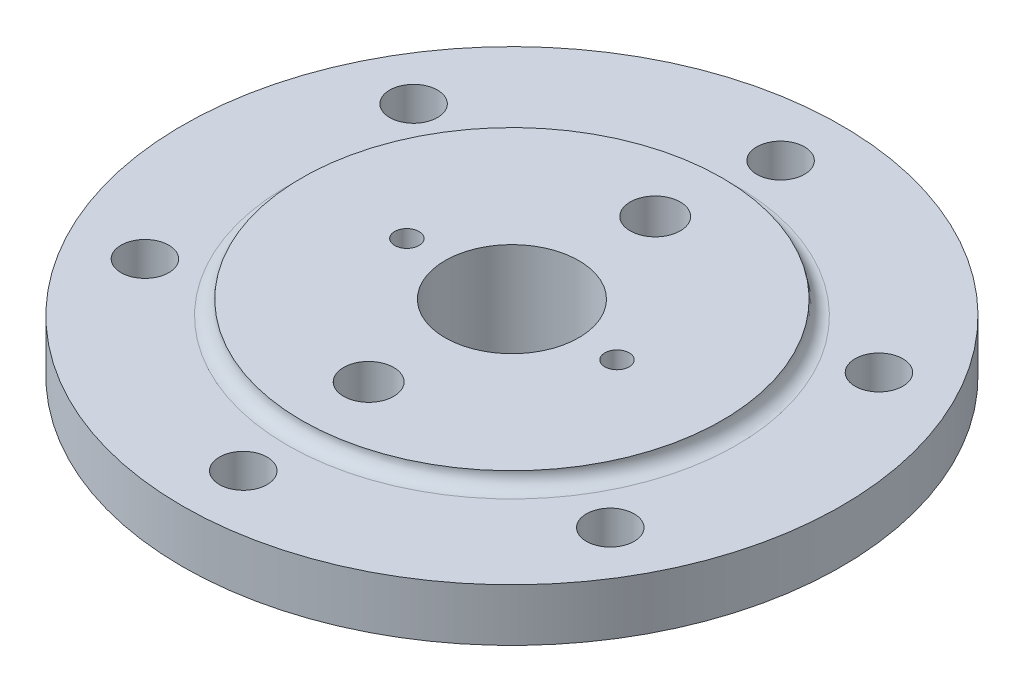
ISO-10303-21;
HEADER;
FILE_DESCRIPTION(('STEP AP214'),'2;1');
FILE_NAME('part.step','',(''),(''),'','','');
FILE_SCHEMA(('AUTOMOTIVE_DESIGN { 1 0 10303 214 1 1 1 1 }'));
ENDSEC;
DATA;
#1=APPLICATION_CONTEXT('core data for automotive mechanical design processes');
#2=APPLICATION_PROTOCOL_DEFINITION('international standard','automotive_design',2000,#1);
#3=PRODUCT_CONTEXT('',#1,'mechanical');
#4=PRODUCT('Part','Part','',(#3));
#5=PRODUCT_RELATED_PRODUCT_CATEGORY('part','',(#4));
#6=PRODUCT_DEFINITION_FORMATION('','',#4);
#7=PRODUCT_DEFINITION_CONTEXT('part definition',#1,'design');
#8=PRODUCT_DEFINITION('design','',#6,#7);
#9=PRODUCT_DEFINITION_SHAPE('','',#8);
#10=(LENGTH_UNIT() NAMED_UNIT(*) SI_UNIT(.MILLI.,.METRE.));
#11=(NAMED_UNIT(*) PLANE_ANGLE_UNIT() SI_UNIT($,.RADIAN.));
#12=(NAMED_UNIT(*) SI_UNIT($,.STERADIAN.) SOLID_ANGLE_UNIT());
#13=UNCERTAINTY_MEASURE_WITH_UNIT(LENGTH_MEASURE(1.E-05),#10,'distance_accuracy_value','');
#14=(GEOMETRIC_REPRESENTATION_CONTEXT(3) GLOBAL_UNCERTAINTY_ASSIGNED_CONTEXT((#13)) GLOBAL_UNIT_ASSIGNED_CONTEXT((#10,
#11,#12)) REPRESENTATION_CONTEXT('',''));
#15=CARTESIAN_POINT('',(0.,0.,0.));
#16=DIRECTION('',(0.,0.,1.));
#17=DIRECTION('',(1.,0.,0.));
#18=AXIS2_PLACEMENT_3D('',#15,#16,#17);
#19=CARTESIAN_POINT('',(0.,40.8228280708899,0.));
#20=DIRECTION('',(0.,1.,0.));
#21=DIRECTION('',(0.,0.,1.));
#22=AXIS2_PLACEMENT_3D('',#19,#20,#21);
#23=CYLINDRICAL_SURFACE('',#22,14.);
#24=CARTESIAN_POINT('',(0.,0.,0.));
#25=DIRECTION('',(0.,1.,0.));
#26=DIRECTION('',(0.,0.,1.));
#27=AXIS2_PLACEMENT_3D('',#24,#25,#26);
#28=CIRCLE('',#27,14.);
#29=CARTESIAN_POINT('',(0.,0.,14.));
#30=VERTEX_POINT('',#29);
#31=EDGE_CURVE('E11',#30,#30,#28,.T.);
#32=ORIENTED_EDGE('',*,*,#31,.F.);
#33=EDGE_LOOP('',(#32));
#34=FACE_BOUND('',#33,.T.);
#35=CARTESIAN_POINT('',(0.,24.9170962313453,0.));
#36=DIRECTION('',(0.,1.,0.));
#37=DIRECTION('',(0.,0.,1.));
#38=AXIS2_PLACEMENT_3D('',#35,#36,#37);
#39=CIRCLE('',#38,14.);
#40=CARTESIAN_POINT('',(0.,24.9170962313453,14.));
#41=VERTEX_POINT('',#40);
#42=EDGE_CURVE('E159',#41,#41,#39,.T.);
#43=ORIENTED_EDGE('',*,*,#42,.T.);
#44=EDGE_LOOP('',(#43));
#45=FACE_BOUND('',#44,.T.);
#46=ADVANCED_FACE('F49',(#34,#45),#23,.F.);
#47=CARTESIAN_POINT('',(0.,0.,-14.));
#48=DIRECTION('',(0.,1.,0.));
#49=DIRECTION('',(0.,0.,1.));
#50=AXIS2_PLACEMENT_3D('',#47,#48,#49);
#51=PLANE('',#50);
#52=CARTESIAN_POINT('',(0.,0.,0.));
#53=DIRECTION('',(0.,1.,0.));
#54=DIRECTION('',(0.,0.,1.));
#55=AXIS2_PLACEMENT_3D('',#52,#53,#54);
#56=CIRCLE('',#55,35.);
#57=CARTESIAN_POINT('',(0.,0.,35.));
#58=VERTEX_POINT('',#57);
#59=EDGE_CURVE('E57',#58,#58,#56,.T.);
#60=ORIENTED_EDGE('',*,*,#59,.F.);
#61=EDGE_LOOP('',(#60));
#62=FACE_BOUND('',#61,.T.);
#63=ORIENTED_EDGE('',*,*,#31,.T.);
#64=EDGE_LOOP('',(#63));
#65=FACE_BOUND('',#64,.T.);
#66=ADVANCED_FACE('F200',(#62,#65),#51,.F.);
#67=CARTESIAN_POINT('',(0.,0.,0.));
#68=DIRECTION('',(0.,1.,0.));
#69=DIRECTION('',(0.,0.,1.));
#70=AXIS2_PLACEMENT_3D('',#67,#68,#69);
#71=CONICAL_SURFACE('',#70,35.,0.774645889606347);
#72=CARTESIAN_POINT('',(0.,47.,0.));
#73=DIRECTION('',(0.,1.,0.));
#74=DIRECTION('',(0.,0.,1.));
#75=AXIS2_PLACEMENT_3D('',#72,#73,#74);
#76=CIRCLE('',#75,81.);
#77=CARTESIAN_POINT('',(0.,47.,81.));
#78=VERTEX_POINT('',#77);
#79=EDGE_CURVE('E191',#78,#78,#76,.T.);
#80=ORIENTED_EDGE('',*,*,#79,.F.);
#81=EDGE_LOOP('',(#80));
#82=FACE_BOUND('',#81,.T.);
#83=ORIENTED_EDGE('',*,*,#59,.T.);
#84=EDGE_LOOP('',(#83));
#85=FACE_BOUND('',#84,.T.);
#86=ADVANCED_FACE('F198',(#82,#85),#71,.T.);
#87=CARTESIAN_POINT('',(0.,40.8228280708899,0.));
#88=DIRECTION('',(0.,1.,0.));
#89=DIRECTION('',(0.,0.,1.));
#90=AXIS2_PLACEMENT_3D('',#87,#88,#89);
#91=CYLINDRICAL_SURFACE('',#90,81.);
#92=CARTESIAN_POINT('',(0.,53.,0.));
#93=DIRECTION('',(0.,1.,0.));
#94=DIRECTION('',(0.,0.,1.));
#95=AXIS2_PLACEMENT_3D('',#92,#93,#94);
#96=CIRCLE('',#95,81.);
#97=CARTESIAN_POINT('',(0.,53.,81.));
#98=VERTEX_POINT('',#97);
#99=EDGE_CURVE('E187',#98,#98,#96,.T.);
#100=ORIENTED_EDGE('',*,*,#99,.F.);
#101=EDGE_LOOP('',(#100));
#102=FACE_BOUND('',#101,.T.);
#103=ORIENTED_EDGE('',*,*,#79,.T.);
#104=EDGE_LOOP('',(#103));
#105=FACE_BOUND('',#104,.T.);
#106=ADVANCED_FACE('F251',(#102,#105),#91,.T.);
#107=CARTESIAN_POINT('',(0.,53.,-81.));
#108=DIRECTION('',(0.,1.,0.));
#109=DIRECTION('',(0.,0.,1.));
#110=AXIS2_PLACEMENT_3D('',#107,#108,#109);
#111=PLANE('',#110);
#112=CARTESIAN_POINT('',(0.,53.,-112.5));
#113=DIRECTION('',(0.,1.,0.));
#114=DIRECTION('',(0.,0.,1.));
#115=AXIS2_PLACEMENT_3D('',#112,#113,#114);
#116=CIRCLE('',#115,10.);
#117=CARTESIAN_POINT('',(0.,53.,-102.5));
#118=VERTEX_POINT('',#117);
#119=EDGE_CURVE('E155',#118,#118,#116,.T.);
#120=ORIENTED_EDGE('',*,*,#119,.T.);
#121=EDGE_LOOP('',(#120));
#122=FACE_BOUND('',#121,.T.);
#123=CARTESIAN_POINT('',(-97.4278579257487,53.,-56.2500000000012));
#124=DIRECTION('',(0.,1.,0.));
#125=DIRECTION('',(0.,0.,1.));
#126=AXIS2_PLACEMENT_3D('',#123,#124,#125);
#127=CIRCLE('',#126,10.);
#128=CARTESIAN_POINT('',(-97.4278579257487,53.,-46.2500000000012));
#129=VERTEX_POINT('',#128);
#130=EDGE_CURVE('E151',#129,#129,#127,.T.);
#131=ORIENTED_EDGE('',*,*,#130,.T.);
#132=EDGE_LOOP('',(#131));
#133=FACE_BOUND('',#132,.T.);
#134=CARTESIAN_POINT('',(-97.4278579257499,53.,56.2499999999991));
#135=DIRECTION('',(0.,1.,0.));
#136=DIRECTION('',(0.,0.,1.));
#137=AXIS2_PLACEMENT_3D('',#134,#135,#136);
#138=CIRCLE('',#137,10.);
#139=CARTESIAN_POINT('',(-97.4278579257499,53.,66.2499999999991));
#140=VERTEX_POINT('',#139);
#141=EDGE_CURVE('E147',#140,#140,#138,.T.);
#142=ORIENTED_EDGE('',*,*,#141,.T.);
#143=EDGE_LOOP('',(#142));
#144=FACE_BOUND('',#143,.T.);
#145=CARTESIAN_POINT('',(-7.85583301239705E-13,53.,112.5));
#146=DIRECTION('',(0.,1.,0.));
#147=DIRECTION('',(0.,0.,1.));
#148=AXIS2_PLACEMENT_3D('',#145,#146,#147);
#149=CIRCLE('',#148,10.);
#150=CARTESIAN_POINT('',(-7.85583301239705E-13,53.,122.5));
#151=VERTEX_POINT('',#150);
#152=EDGE_CURVE('E143',#151,#151,#149,.T.);
#153=ORIENTED_EDGE('',*,*,#152,.T.);
#154=EDGE_LOOP('',(#153));
#155=FACE_BOUND('',#154,.T.);
#156=CARTESIAN_POINT('',(97.4278579257491,53.,56.2500000000005));
#157=DIRECTION('',(0.,1.,0.));
#158=DIRECTION('',(0.,0.,1.));
#159=AXIS2_PLACEMENT_3D('',#156,#157,#158);
#160=CIRCLE('',#159,10.);
#161=CARTESIAN_POINT('',(97.4278579257491,53.,66.2500000000005));
#162=VERTEX_POINT('',#161);
#163=EDGE_CURVE('E139',#162,#162,#160,.T.);
#164=ORIENTED_EDGE('',*,*,#163,.T.);
#165=EDGE_LOOP('',(#164));
#166=FACE_BOUND('',#165,.T.);
#167=CARTESIAN_POINT('',(97.4278579257495,53.,-56.2499999999998));
#168=DIRECTION('',(0.,1.,0.));
#169=DIRECTION('',(0.,0.,1.));
#170=AXIS2_PLACEMENT_3D('',#167,#168,#169);
#171=CIRCLE('',#170,9.99999999999999);
#172=CARTESIAN_POINT('',(97.4278579257495,53.,-46.2499999999998));
#173=VERTEX_POINT('',#172);
#174=EDGE_CURVE('E116',#173,#173,#171,.T.);
#175=ORIENTED_EDGE('',*,*,#174,.T.);
#176=EDGE_LOOP('',(#175));
#177=FACE_BOUND('',#176,.T.);
#178=CARTESIAN_POINT('',(0.,53.,0.));
#179=DIRECTION('',(0.,1.,0.));
#180=DIRECTION('',(0.,0.,1.));
#181=AXIS2_PLACEMENT_3D('',#178,#179,#180);
#182=CIRCLE('',#181,138.);
#183=CARTESIAN_POINT('',(0.,53.,138.));
#184=VERTEX_POINT('',#183);
#185=EDGE_CURVE('E183',#184,#184,#182,.T.);
#186=ORIENTED_EDGE('',*,*,#185,.F.);
#187=EDGE_LOOP('',(#186));
#188=FACE_BOUND('',#187,.T.);
#189=ORIENTED_EDGE('',*,*,#99,.T.);
#190=EDGE_LOOP('',(#189));
#191=FACE_BOUND('',#190,.T.);
#192=ADVANCED_FACE('F245',(#122,#133,#144,#155,#166,#177,#188,#191),#111,.F.);
#193=CARTESIAN_POINT('',(0.,40.8228280708899,0.));
#194=DIRECTION('',(0.,1.,0.));
#195=DIRECTION('',(0.,0.,1.));
#196=AXIS2_PLACEMENT_3D('',#193,#194,#195);
#197=CYLINDRICAL_SURFACE('',#196,138.);
#198=CARTESIAN_POINT('',(0.,75.,0.));
#199=DIRECTION('',(0.,1.,0.));
#200=DIRECTION('',(0.,0.,1.));
#201=AXIS2_PLACEMENT_3D('',#198,#199,#200);
#202=CIRCLE('',#201,138.);
#203=CARTESIAN_POINT('',(0.,75.,138.));
#204=VERTEX_POINT('',#203);
#205=EDGE_CURVE('E179',#204,#204,#202,.T.);
#206=ORIENTED_EDGE('',*,*,#205,.F.);
#207=EDGE_LOOP('',(#206));
#208=FACE_BOUND('',#207,.T.);
#209=ORIENTED_EDGE('',*,*,#185,.T.);
#210=EDGE_LOOP('',(#209));
#211=FACE_BOUND('',#210,.T.);
#212=ADVANCED_FACE('F238',(#208,#211),#197,.T.);
#213=CARTESIAN_POINT('',(0.,75.,-138.));
#214=DIRECTION('',(0.,-1.,0.));
#215=DIRECTION('',(0.,0.,-1.));
#216=AXIS2_PLACEMENT_3D('',#213,#214,#215);
#217=PLANE('',#216);
#218=CARTESIAN_POINT('',(0.,75.,-112.5));
#219=DIRECTION('',(0.,1.,0.));
#220=DIRECTION('',(0.,0.,1.));
#221=AXIS2_PLACEMENT_3D('',#218,#219,#220);
#222=CIRCLE('',#221,10.);
#223=CARTESIAN_POINT('',(0.,75.,-102.5));
#224=VERTEX_POINT('',#223);
#225=EDGE_CURVE('E112',#224,#224,#222,.T.);
#226=ORIENTED_EDGE('',*,*,#225,.F.);
#227=EDGE_LOOP('',(#226));
#228=FACE_BOUND('',#227,.T.);
#229=CARTESIAN_POINT('',(-97.4278579257487,75.,-56.2500000000012));
#230=DIRECTION('',(0.,1.,0.));
#231=DIRECTION('',(0.,0.,1.));
#232=AXIS2_PLACEMENT_3D('',#229,#230,#231);
#233=CIRCLE('',#232,10.);
#234=CARTESIAN_POINT('',(-97.4278579257487,75.,-46.2500000000012));
#235=VERTEX_POINT('',#234);
#236=EDGE_CURVE('E111',#235,#235,#233,.T.);
#237=ORIENTED_EDGE('',*,*,#236,.F.);
#238=EDGE_LOOP('',(#237));
#239=FACE_BOUND('',#238,.T.);
#240=CARTESIAN_POINT('',(-97.4278579257499,75.,56.2499999999991));
#241=DIRECTION('',(0.,1.,0.));
#242=DIRECTION('',(0.,0.,1.));
#243=AXIS2_PLACEMENT_3D('',#240,#241,#242);
#244=CIRCLE('',#243,10.);
#245=CARTESIAN_POINT('',(-97.4278579257499,75.,66.2499999999991));
#246=VERTEX_POINT('',#245);
#247=EDGE_CURVE('E121',#246,#246,#244,.T.);
#248=ORIENTED_EDGE('',*,*,#247,.F.);
#249=EDGE_LOOP('',(#248));
#250=FACE_BOUND('',#249,.T.);
#251=CARTESIAN_POINT('',(-7.85583301239705E-13,75.,112.5));
#252=DIRECTION('',(0.,1.,0.));
#253=DIRECTION('',(0.,0.,1.));
#254=AXIS2_PLACEMENT_3D('',#251,#252,#253);
#255=CIRCLE('',#254,10.);
#256=CARTESIAN_POINT('',(-7.85583301239705E-13,75.,122.5));
#257=VERTEX_POINT('',#256);
#258=EDGE_CURVE('E129',#257,#257,#255,.T.);
#259=ORIENTED_EDGE('',*,*,#258,.F.);
#260=EDGE_LOOP('',(#259));
#261=FACE_BOUND('',#260,.T.);
#262=CARTESIAN_POINT('',(97.4278579257491,75.,56.2500000000005));
#263=DIRECTION('',(0.,1.,0.));
#264=DIRECTION('',(0.,0.,1.));
#265=AXIS2_PLACEMENT_3D('',#262,#263,#264);
#266=CIRCLE('',#265,10.);
#267=CARTESIAN_POINT('',(97.4278579257491,75.,66.2500000000005));
#268=VERTEX_POINT('',#267);
#269=EDGE_CURVE('E125',#268,#268,#266,.T.);
#270=ORIENTED_EDGE('',*,*,#269,.F.);
#271=EDGE_LOOP('',(#270));
#272=FACE_BOUND('',#271,.T.);
#273=CARTESIAN_POINT('',(97.4278579257495,75.,-56.2499999999998));
#274=DIRECTION('',(0.,1.,0.));
#275=DIRECTION('',(0.,0.,1.));
#276=AXIS2_PLACEMENT_3D('',#273,#274,#275);
#277=CIRCLE('',#276,9.99999999999999);
#278=CARTESIAN_POINT('',(97.4278579257495,75.,-46.2499999999998));
#279=VERTEX_POINT('',#278);
#280=EDGE_CURVE('E117',#279,#279,#277,.T.);
#281=ORIENTED_EDGE('',*,*,#280,.F.);
#282=EDGE_LOOP('',(#281));
#283=FACE_BOUND('',#282,.T.);
#284=CARTESIAN_POINT('',(0.,75.,0.));
#285=DIRECTION('',(0.,1.,0.));
#286=DIRECTION('',(0.,0.,1.));
#287=AXIS2_PLACEMENT_3D('',#284,#285,#286);
#288=CIRCLE('',#287,94.);
#289=CARTESIAN_POINT('',(0.,75.,94.));
#290=VERTEX_POINT('',#289);
#291=EDGE_CURVE('E175',#290,#290,#288,.T.);
#292=ORIENTED_EDGE('',*,*,#291,.F.);
#293=EDGE_LOOP('',(#292));
#294=FACE_BOUND('',#293,.T.);
#295=ORIENTED_EDGE('',*,*,#205,.T.);
#296=EDGE_LOOP('',(#295));
#297=FACE_BOUND('',#296,.T.);
#298=ADVANCED_FACE('F232',(#228,#239,#250,#261,#272,#283,#294,#297),#217,.F.);
#299=CARTESIAN_POINT('',(0.,81.,0.));
#300=DIRECTION('',(0.,1.,0.));
#301=DIRECTION('',(0.,0.,1.));
#302=AXIS2_PLACEMENT_3D('',#299,#300,#301);
#303=TOROIDAL_SURFACE('',#302,94.,6.00000000000001);
#304=CARTESIAN_POINT('',(0.,81.,0.));
#305=DIRECTION('',(0.,1.,0.));
#306=DIRECTION('',(0.,0.,1.));
#307=AXIS2_PLACEMENT_3D('',#304,#305,#306);
#308=CIRCLE('',#307,88.);
#309=CARTESIAN_POINT('',(0.,81.,88.));
#310=VERTEX_POINT('',#309);
#311=EDGE_CURVE('E171',#310,#310,#308,.T.);
#312=ORIENTED_EDGE('',*,*,#311,.F.);
#313=EDGE_LOOP('',(#312));
#314=FACE_BOUND('',#313,.T.);
#315=ORIENTED_EDGE('',*,*,#291,.T.);
#316=EDGE_LOOP('',(#315));
#317=FACE_BOUND('',#316,.T.);
#318=ADVANCED_FACE('F225',(#314,#317),#303,.F.);
#319=CARTESIAN_POINT('',(0.,81.,-88.));
#320=DIRECTION('',(0.,-1.,0.));
#321=DIRECTION('',(0.,0.,-1.));
#322=AXIS2_PLACEMENT_3D('',#319,#320,#321);
#323=PLANE('',#322);
#324=CARTESIAN_POINT('',(-44.,81.,0.));
#325=DIRECTION('',(0.,1.,0.));
#326=DIRECTION('',(0.,0.,1.));
#327=AXIS2_PLACEMENT_3D('',#324,#325,#326);
#328=CIRCLE('',#327,5.09999999999999);
#329=CARTESIAN_POINT('',(-44.,81.,5.09999999999999));
#330=VERTEX_POINT('',#329);
#331=EDGE_CURVE('E82',#330,#330,#328,.T.);
#332=ORIENTED_EDGE('',*,*,#331,.F.);
#333=EDGE_LOOP('',(#332));
#334=FACE_BOUND('',#333,.T.);
#335=CARTESIAN_POINT('',(44.,81.,0.));
#336=DIRECTION('',(0.,1.,0.));
#337=DIRECTION('',(0.,0.,1.));
#338=AXIS2_PLACEMENT_3D('',#335,#336,#337);
#339=CIRCLE('',#338,5.09999999999999);
#340=CARTESIAN_POINT('',(44.,81.,5.09999999999998));
#341=VERTEX_POINT('',#340);
#342=EDGE_CURVE('E81',#341,#341,#339,.T.);
#343=ORIENTED_EDGE('',*,*,#342,.F.);
#344=EDGE_LOOP('',(#343));
#345=FACE_BOUND('',#344,.T.);
#346=CARTESIAN_POINT('',(0.,81.,60.));
#347=DIRECTION('',(0.,1.,0.));
#348=DIRECTION('',(0.,0.,1.));
#349=AXIS2_PLACEMENT_3D('',#346,#347,#348);
#350=CIRCLE('',#349,10.5);
#351=CARTESIAN_POINT('',(0.,81.,70.5));
#352=VERTEX_POINT('',#351);
#353=EDGE_CURVE('E95',#352,#352,#350,.T.);
#354=ORIENTED_EDGE('',*,*,#353,.F.);
#355=EDGE_LOOP('',(#354));
#356=FACE_BOUND('',#355,.T.);
#357=CARTESIAN_POINT('',(0.,81.,-60.));
#358=DIRECTION('',(0.,1.,0.));
#359=DIRECTION('',(0.,0.,1.));
#360=AXIS2_PLACEMENT_3D('',#357,#358,#359);
#361=CIRCLE('',#360,10.5);
#362=CARTESIAN_POINT('',(0.,81.,-49.5));
#363=VERTEX_POINT('',#362);
#364=EDGE_CURVE('E103',#363,#363,#361,.T.);
#365=ORIENTED_EDGE('',*,*,#364,.F.);
#366=EDGE_LOOP('',(#365));
#367=FACE_BOUND('',#366,.T.);
#368=CARTESIAN_POINT('',(0.,81.,0.));
#369=DIRECTION('',(0.,1.,0.));
#370=DIRECTION('',(0.,0.,1.));
#371=AXIS2_PLACEMENT_3D('',#368,#369,#370);
#372=CIRCLE('',#371,28.);
#373=CARTESIAN_POINT('',(0.,81.,28.));
#374=VERTEX_POINT('',#373);
#375=EDGE_CURVE('E167',#374,#374,#372,.T.);
#376=ORIENTED_EDGE('',*,*,#375,.F.);
#377=EDGE_LOOP('',(#376));
#378=FACE_BOUND('',#377,.T.);
#379=ORIENTED_EDGE('',*,*,#311,.T.);
#380=EDGE_LOOP('',(#379));
#381=FACE_BOUND('',#380,.T.);
#382=ADVANCED_FACE('F219',(#334,#345,#356,#367,#378,#381),#323,.F.);
#383=CARTESIAN_POINT('',(0.,40.8228280708899,0.));
#384=DIRECTION('',(0.,1.,0.));
#385=DIRECTION('',(0.,0.,1.));
#386=AXIS2_PLACEMENT_3D('',#383,#384,#385);
#387=CYLINDRICAL_SURFACE('',#386,28.);
#388=CARTESIAN_POINT('',(0.,33.,0.));
#389=DIRECTION('',(0.,1.,0.));
#390=DIRECTION('',(0.,0.,1.));
#391=AXIS2_PLACEMENT_3D('',#388,#389,#390);
#392=CIRCLE('',#391,28.);
#393=CARTESIAN_POINT('',(0.,33.,28.));
#394=VERTEX_POINT('',#393);
#395=EDGE_CURVE('E163',#394,#394,#392,.T.);
#396=ORIENTED_EDGE('',*,*,#395,.F.);
#397=EDGE_LOOP('',(#396));
#398=FACE_BOUND('',#397,.T.);
#399=ORIENTED_EDGE('',*,*,#375,.T.);
#400=EDGE_LOOP('',(#399));
#401=FACE_BOUND('',#400,.T.);
#402=ADVANCED_FACE('F213',(#398,#401),#387,.F.);
#403=CARTESIAN_POINT('',(0.,33.,0.));
#404=DIRECTION('',(0.,1.,0.));
#405=DIRECTION('',(0.,0.,1.));
#406=AXIS2_PLACEMENT_3D('',#403,#404,#405);
#407=CONICAL_SURFACE('',#406,28.,1.0471975511966);
#408=ORIENTED_EDGE('',*,*,#42,.F.);
#409=EDGE_LOOP('',(#408));
#410=FACE_BOUND('',#409,.T.);
#411=ORIENTED_EDGE('',*,*,#395,.T.);
#412=EDGE_LOOP('',(#411));
#413=FACE_BOUND('',#412,.T.);
#414=ADVANCED_FACE('F209',(#410,#413),#407,.F.);
#415=CARTESIAN_POINT('',(97.4278579257495,0.,-56.2499999999998));
#416=DIRECTION('',(0.,1.,0.));
#417=DIRECTION('',(0.,0.,1.));
#418=AXIS2_PLACEMENT_3D('',#415,#416,#417);
#419=CYLINDRICAL_SURFACE('',#418,9.99999999999999);
#420=ORIENTED_EDGE('',*,*,#280,.T.);
#421=EDGE_LOOP('',(#420));
#422=FACE_BOUND('',#421,.T.);
#423=ORIENTED_EDGE('',*,*,#174,.F.);
#424=EDGE_LOOP('',(#423));
#425=FACE_BOUND('',#424,.T.);
#426=ADVANCED_FACE('F212',(#422,#425),#419,.F.);
#427=CARTESIAN_POINT('',(97.4278579257491,0.,56.2500000000005));
#428=DIRECTION('',(0.,1.,0.));
#429=DIRECTION('',(0.,0.,1.));
#430=AXIS2_PLACEMENT_3D('',#427,#428,#429);
#431=CYLINDRICAL_SURFACE('',#430,10.);
#432=ORIENTED_EDGE('',*,*,#269,.T.);
#433=EDGE_LOOP('',(#432));
#434=FACE_BOUND('',#433,.T.);
#435=ORIENTED_EDGE('',*,*,#163,.F.);
#436=EDGE_LOOP('',(#435));
#437=FACE_BOUND('',#436,.T.);
#438=ADVANCED_FACE('F274',(#434,#437),#431,.F.);
#439=CARTESIAN_POINT('',(-7.85583301239705E-13,0.,112.5));
#440=DIRECTION('',(0.,1.,0.));
#441=DIRECTION('',(0.,0.,1.));
#442=AXIS2_PLACEMENT_3D('',#439,#440,#441);
#443=CYLINDRICAL_SURFACE('',#442,10.);
#444=ORIENTED_EDGE('',*,*,#258,.T.);
#445=EDGE_LOOP('',(#444));
#446=FACE_BOUND('',#445,.T.);
#447=ORIENTED_EDGE('',*,*,#152,.F.);
#448=EDGE_LOOP('',(#447));
#449=FACE_BOUND('',#448,.T.);
#450=ADVANCED_FACE('F270',(#446,#449),#443,.F.);
#451=CARTESIAN_POINT('',(-97.4278579257499,0.,56.2499999999991));
#452=DIRECTION('',(0.,1.,0.));
#453=DIRECTION('',(0.,0.,1.));
#454=AXIS2_PLACEMENT_3D('',#451,#452,#453);
#455=CYLINDRICAL_SURFACE('',#454,10.);
#456=ORIENTED_EDGE('',*,*,#247,.T.);
#457=EDGE_LOOP('',(#456));
#458=FACE_BOUND('',#457,.T.);
#459=ORIENTED_EDGE('',*,*,#141,.F.);
#460=EDGE_LOOP('',(#459));
#461=FACE_BOUND('',#460,.T.);
#462=ADVANCED_FACE('F266',(#458,#461),#455,.F.);
#463=CARTESIAN_POINT('',(-97.4278579257487,0.,-56.2500000000012));
#464=DIRECTION('',(0.,1.,0.));
#465=DIRECTION('',(0.,0.,1.));
#466=AXIS2_PLACEMENT_3D('',#463,#464,#465);
#467=CYLINDRICAL_SURFACE('',#466,10.);
#468=ORIENTED_EDGE('',*,*,#236,.T.);
#469=EDGE_LOOP('',(#468));
#470=FACE_BOUND('',#469,.T.);
#471=ORIENTED_EDGE('',*,*,#130,.F.);
#472=EDGE_LOOP('',(#471));
#473=FACE_BOUND('',#472,.T.);
#474=ADVANCED_FACE('F269',(#470,#473),#467,.F.);
#475=CARTESIAN_POINT('',(0.,0.,-112.5));
#476=DIRECTION('',(0.,1.,0.));
#477=DIRECTION('',(0.,0.,1.));
#478=AXIS2_PLACEMENT_3D('',#475,#476,#477);
#479=CYLINDRICAL_SURFACE('',#478,10.);
#480=ORIENTED_EDGE('',*,*,#225,.T.);
#481=EDGE_LOOP('',(#480));
#482=FACE_BOUND('',#481,.T.);
#483=ORIENTED_EDGE('',*,*,#119,.F.);
#484=EDGE_LOOP('',(#483));
#485=FACE_BOUND('',#484,.T.);
#486=ADVANCED_FACE('F284',(#482,#485),#479,.F.);
#487=CARTESIAN_POINT('',(0.,54.,-60.));
#488=DIRECTION('',(0.,1.,0.));
#489=DIRECTION('',(0.,0.,1.));
#490=AXIS2_PLACEMENT_3D('',#487,#488,#489);
#491=CONICAL_SURFACE('',#490,10.5,1.02974425867665);
#492=CARTESIAN_POINT('',(0.,47.6909635002106,-60.));
#493=VERTEX_POINT('',#492);
#494=VERTEX_LOOP('',#493);
#495=FACE_BOUND('',#494,.T.);
#496=CARTESIAN_POINT('',(0.,54.,-60.));
#497=DIRECTION('',(0.,1.,0.));
#498=DIRECTION('',(0.,0.,1.));
#499=AXIS2_PLACEMENT_3D('',#496,#497,#498);
#500=CIRCLE('',#499,10.5);
#501=CARTESIAN_POINT('',(0.,54.,-49.5));
#502=VERTEX_POINT('',#501);
#503=EDGE_CURVE('E107',#502,#502,#500,.T.);
#504=ORIENTED_EDGE('',*,*,#503,.T.);
#505=EDGE_LOOP('',(#504));
#506=FACE_BOUND('',#505,.T.);
#507=ADVANCED_FACE('F288',(#495,#506),#491,.F.);
#508=CARTESIAN_POINT('',(0.,81.,-60.));
#509=DIRECTION('',(0.,1.,0.));
#510=DIRECTION('',(0.,0.,1.));
#511=AXIS2_PLACEMENT_3D('',#508,#509,#510);
#512=CYLINDRICAL_SURFACE('',#511,10.5);
#513=ORIENTED_EDGE('',*,*,#503,.F.);
#514=EDGE_LOOP('',(#513));
#515=FACE_BOUND('',#514,.T.);
#516=ORIENTED_EDGE('',*,*,#364,.T.);
#517=EDGE_LOOP('',(#516));
#518=FACE_BOUND('',#517,.T.);
#519=ADVANCED_FACE('F292',(#515,#518),#512,.F.);
#520=CARTESIAN_POINT('',(0.,54.,60.));
#521=DIRECTION('',(0.,1.,0.));
#522=DIRECTION('',(0.,0.,1.));
#523=AXIS2_PLACEMENT_3D('',#520,#521,#522);
#524=CONICAL_SURFACE('',#523,10.5,1.02974425867665);
#525=CARTESIAN_POINT('',(0.,47.6909635002106,60.));
#526=VERTEX_POINT('',#525);
#527=VERTEX_LOOP('',#526);
#528=FACE_BOUND('',#527,.T.);
#529=CARTESIAN_POINT('',(0.,54.,60.));
#530=DIRECTION('',(0.,1.,0.));
#531=DIRECTION('',(0.,0.,1.));
#532=AXIS2_PLACEMENT_3D('',#529,#530,#531);
#533=CIRCLE('',#532,10.5);
#534=CARTESIAN_POINT('',(0.,54.,70.5));
#535=VERTEX_POINT('',#534);
#536=EDGE_CURVE('E99',#535,#535,#533,.T.);
#537=ORIENTED_EDGE('',*,*,#536,.T.);
#538=EDGE_LOOP('',(#537));
#539=FACE_BOUND('',#538,.T.);
#540=ADVANCED_FACE('F295',(#528,#539),#524,.F.);
#541=CARTESIAN_POINT('',(0.,81.,60.));
#542=DIRECTION('',(0.,1.,0.));
#543=DIRECTION('',(0.,0.,1.));
#544=AXIS2_PLACEMENT_3D('',#541,#542,#543);
#545=CYLINDRICAL_SURFACE('',#544,10.5);
#546=ORIENTED_EDGE('',*,*,#536,.F.);
#547=EDGE_LOOP('',(#546));
#548=FACE_BOUND('',#547,.T.);
#549=ORIENTED_EDGE('',*,*,#353,.T.);
#550=EDGE_LOOP('',(#549));
#551=FACE_BOUND('',#550,.T.);
#552=ADVANCED_FACE('F299',(#548,#551),#545,.F.);
#553=CARTESIAN_POINT('',(44.,66.,0.));
#554=DIRECTION('',(0.,1.,0.));
#555=DIRECTION('',(0.,0.,1.));
#556=AXIS2_PLACEMENT_3D('',#553,#554,#555);
#557=CONICAL_SURFACE('',#556,5.09999999999999,1.02974425867665);
#558=CARTESIAN_POINT('',(44.,62.9356108429595,0.));
#559=VERTEX_POINT('',#558);
#560=VERTEX_LOOP('',#559);
#561=FACE_BOUND('',#560,.T.);
#562=CARTESIAN_POINT('',(44.,66.,0.));
#563=DIRECTION('',(0.,1.,0.));
#564=DIRECTION('',(0.,0.,1.));
#565=AXIS2_PLACEMENT_3D('',#562,#563,#564);
#566=CIRCLE('',#565,5.09999999999999);
#567=CARTESIAN_POINT('',(44.,66.,5.09999999999998));
#568=VERTEX_POINT('',#567);
#569=EDGE_CURVE('E87',#568,#568,#566,.T.);
#570=ORIENTED_EDGE('',*,*,#569,.T.);
#571=EDGE_LOOP('',(#570));
#572=FACE_BOUND('',#571,.T.);
#573=ADVANCED_FACE('F302',(#561,#572),#557,.F.);
#574=CARTESIAN_POINT('',(44.,81.,0.));
#575=DIRECTION('',(0.,1.,0.));
#576=DIRECTION('',(0.,0.,1.));
#577=AXIS2_PLACEMENT_3D('',#574,#575,#576);
#578=CYLINDRICAL_SURFACE('',#577,5.09999999999999);
#579=ORIENTED_EDGE('',*,*,#569,.F.);
#580=EDGE_LOOP('',(#579));
#581=FACE_BOUND('',#580,.T.);
#582=ORIENTED_EDGE('',*,*,#342,.T.);
#583=EDGE_LOOP('',(#582));
#584=FACE_BOUND('',#583,.T.);
#585=ADVANCED_FACE('F74',(#581,#584),#578,.F.);
#586=CARTESIAN_POINT('',(-44.,66.,0.));
#587=DIRECTION('',(0.,1.,0.));
#588=DIRECTION('',(0.,0.,1.));
#589=AXIS2_PLACEMENT_3D('',#586,#587,#588);
#590=CONICAL_SURFACE('',#589,5.09999999999999,1.02974425867665);
#591=CARTESIAN_POINT('',(-44.,62.9356108429595,0.));
#592=VERTEX_POINT('',#591);
#593=VERTEX_LOOP('',#592);
#594=FACE_BOUND('',#593,.T.);
#595=CARTESIAN_POINT('',(-44.,66.,0.));
#596=DIRECTION('',(0.,1.,0.));
#597=DIRECTION('',(0.,0.,1.));
#598=AXIS2_PLACEMENT_3D('',#595,#596,#597);
#599=CIRCLE('',#598,5.09999999999999);
#600=CARTESIAN_POINT('',(-44.,66.,5.09999999999999));
#601=VERTEX_POINT('',#600);
#602=EDGE_CURVE('E78',#601,#601,#599,.T.);
#603=ORIENTED_EDGE('',*,*,#602,.T.);
#604=EDGE_LOOP('',(#603));
#605=FACE_BOUND('',#604,.T.);
#606=ADVANCED_FACE('F70',(#594,#605),#590,.F.);
#607=CARTESIAN_POINT('',(-44.,81.,0.));
#608=DIRECTION('',(0.,1.,0.));
#609=DIRECTION('',(0.,0.,1.));
#610=AXIS2_PLACEMENT_3D('',#607,#608,#609);
#611=CYLINDRICAL_SURFACE('',#610,5.09999999999999);
#612=ORIENTED_EDGE('',*,*,#602,.F.);
#613=EDGE_LOOP('',(#612));
#614=FACE_BOUND('',#613,.T.);
#615=ORIENTED_EDGE('',*,*,#331,.T.);
#616=EDGE_LOOP('',(#615));
#617=FACE_BOUND('',#616,.T.);
#618=ADVANCED_FACE('F73',(#614,#617),#611,.F.);
#619=CLOSED_SHELL('',(#46,#66,#86,#106,#192,#212,#298,#318,#382,#402,#414,#426,#438,#450,#462,
#474,#486,#507,#519,#540,#552,#573,#585,#606,#618));
#620=MANIFOLD_SOLID_BREP('B2',#619);
#621=ADVANCED_BREP_SHAPE_REPRESENTATION('',(#18,#620),#14);
#622=SHAPE_DEFINITION_REPRESENTATION(#9,#621);
ENDSEC;
END-ISO-10303-21;
